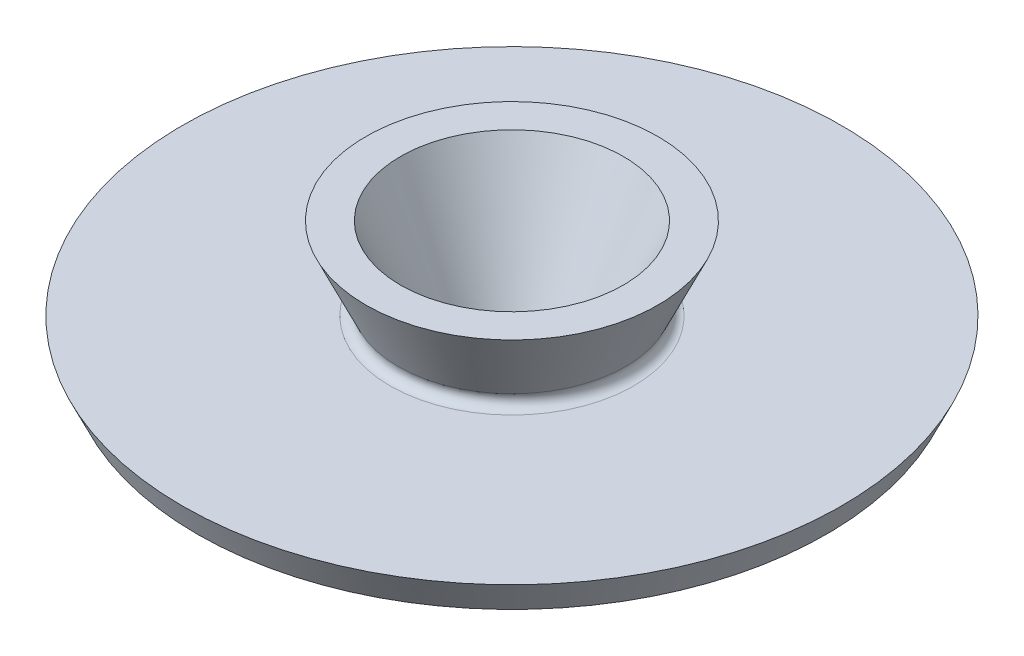
ISO-10303-21;
HEADER;
FILE_DESCRIPTION(('STEP AP214'),'2;1');
FILE_NAME('part.step','',(''),(''),'','','');
FILE_SCHEMA(('AUTOMOTIVE_DESIGN { 1 0 10303 214 1 1 1 1 }'));
ENDSEC;
DATA;
#1=APPLICATION_CONTEXT('core data for automotive mechanical design processes');
#2=APPLICATION_PROTOCOL_DEFINITION('international standard','automotive_design',2000,#1);
#3=PRODUCT_CONTEXT('',#1,'mechanical');
#4=PRODUCT('Part','Part','',(#3));
#5=PRODUCT_RELATED_PRODUCT_CATEGORY('part','',(#4));
#6=PRODUCT_DEFINITION_FORMATION('','',#4);
#7=PRODUCT_DEFINITION_CONTEXT('part definition',#1,'design');
#8=PRODUCT_DEFINITION('design','',#6,#7);
#9=PRODUCT_DEFINITION_SHAPE('','',#8);
#10=(LENGTH_UNIT() NAMED_UNIT(*) SI_UNIT(.MILLI.,.METRE.));
#11=(NAMED_UNIT(*) PLANE_ANGLE_UNIT() SI_UNIT($,.RADIAN.));
#12=(NAMED_UNIT(*) SI_UNIT($,.STERADIAN.) SOLID_ANGLE_UNIT());
#13=UNCERTAINTY_MEASURE_WITH_UNIT(LENGTH_MEASURE(1.E-05),#10,'distance_accuracy_value','');
#14=(GEOMETRIC_REPRESENTATION_CONTEXT(3) GLOBAL_UNCERTAINTY_ASSIGNED_CONTEXT((#13)) GLOBAL_UNIT_ASSIGNED_CONTEXT((#10,
#11,#12)) REPRESENTATION_CONTEXT('',''));
#15=CARTESIAN_POINT('',(0.,0.,0.));
#16=DIRECTION('',(0.,0.,1.));
#17=DIRECTION('',(1.,0.,0.));
#18=AXIS2_PLACEMENT_3D('',#15,#16,#17);
#19=CARTESIAN_POINT('',(-93.6738442409776,4.48939488910319,0.));
#20=DIRECTION('',(0.,1.,0.));
#21=DIRECTION('',(0.,0.,1.));
#22=AXIS2_PLACEMENT_3D('',#19,#20,#21);
#23=PLANE('',#22);
#24=CARTESIAN_POINT('',(0.,4.48939488910319,0.));
#25=DIRECTION('',(0.,1.,0.));
#26=DIRECTION('',(0.,0.,1.));
#27=AXIS2_PLACEMENT_3D('',#24,#25,#26);
#28=CIRCLE('',#27,93.6738442409776);
#29=CARTESIAN_POINT('',(0.,4.48939488910319,93.6738442409776));
#30=VERTEX_POINT('',#29);
#31=EDGE_CURVE('E76',#30,#30,#28,.T.);
#32=ORIENTED_EDGE('',*,*,#31,.T.);
#33=EDGE_LOOP('',(#32));
#34=FACE_BOUND('',#33,.T.);
#35=CARTESIAN_POINT('',(0.,4.48939488910319,0.));
#36=DIRECTION('',(0.,1.,0.));
#37=DIRECTION('',(0.,0.,1.));
#38=AXIS2_PLACEMENT_3D('',#35,#36,#37);
#39=CIRCLE('',#38,34.6027975381496);
#40=CARTESIAN_POINT('',(0.,4.48939488910319,34.6027975381496));
#41=VERTEX_POINT('',#40);
#42=EDGE_CURVE('E10',#41,#41,#39,.T.);
#43=ORIENTED_EDGE('',*,*,#42,.F.);
#44=EDGE_LOOP('',(#43));
#45=FACE_BOUND('',#44,.T.);
#46=ADVANCED_FACE('F37',(#34,#45),#23,.T.);
#47=CARTESIAN_POINT('',(0.,7.02939488910319,0.));
#48=DIRECTION('',(0.,1.,0.));
#49=DIRECTION('',(0.,0.,1.));
#50=AXIS2_PLACEMENT_3D('',#47,#48,#49);
#51=TOROIDAL_SURFACE('',#50,34.6027975381496,2.54);
#52=ORIENTED_EDGE('',*,*,#42,.T.);
#53=EDGE_LOOP('',(#52));
#54=FACE_BOUND('',#53,.T.);
#55=CARTESIAN_POINT('',(0.,8.10284527392458,0.));
#56=DIRECTION('',(0.,1.,0.));
#57=DIRECTION('',(0.,0.,1.));
#58=AXIS2_PLACEMENT_3D('',#55,#56,#57);
#59=CIRCLE('',#58,32.3007757590765);
#60=CARTESIAN_POINT('',(0.,8.10284527392458,32.3007757590765));
#61=VERTEX_POINT('',#60);
#62=EDGE_CURVE('E44',#61,#61,#59,.T.);
#63=ORIENTED_EDGE('',*,*,#62,.F.);
#64=EDGE_LOOP('',(#63));
#65=FACE_BOUND('',#64,.T.);
#66=ADVANCED_FACE('F95',(#54,#65),#51,.F.);
#67=CARTESIAN_POINT('',(0.,27.852774652119,0.));
#68=DIRECTION('',(0.,1.,0.));
#69=DIRECTION('',(0.,0.,1.));
#70=AXIS2_PLACEMENT_3D('',#67,#68,#69);
#71=CONICAL_SURFACE('',#70,41.510319076149,0.436332312998584);
#72=ORIENTED_EDGE('',*,*,#62,.T.);
#73=EDGE_LOOP('',(#72));
#74=FACE_BOUND('',#73,.T.);
#75=CARTESIAN_POINT('',(0.,27.852774652119,0.));
#76=DIRECTION('',(0.,1.,0.));
#77=DIRECTION('',(0.,0.,1.));
#78=AXIS2_PLACEMENT_3D('',#75,#76,#77);
#79=CIRCLE('',#78,41.510319076149);
#80=CARTESIAN_POINT('',(0.,27.852774652119,41.510319076149));
#81=VERTEX_POINT('',#80);
#82=EDGE_CURVE('E49',#81,#81,#79,.T.);
#83=ORIENTED_EDGE('',*,*,#82,.F.);
#84=EDGE_LOOP('',(#83));
#85=FACE_BOUND('',#84,.T.);
#86=ADVANCED_FACE('F99',(#74,#85),#71,.T.);
#87=CARTESIAN_POINT('',(-41.510319076149,27.852774652119,0.));
#88=DIRECTION('',(0.,1.,0.));
#89=DIRECTION('',(0.,0.,1.));
#90=AXIS2_PLACEMENT_3D('',#87,#88,#89);
#91=PLANE('',#90);
#92=ORIENTED_EDGE('',*,*,#82,.T.);
#93=EDGE_LOOP('',(#92));
#94=FACE_BOUND('',#93,.T.);
#95=CARTESIAN_POINT('',(0.,27.852774652119,0.));
#96=DIRECTION('',(0.,1.,0.));
#97=DIRECTION('',(0.,0.,1.));
#98=AXIS2_PLACEMENT_3D('',#95,#96,#97);
#99=CIRCLE('',#98,31.6856489220234);
#100=CARTESIAN_POINT('',(0.,27.852774652119,31.6856489220234));
#101=VERTEX_POINT('',#100);
#102=EDGE_CURVE('E54',#101,#101,#99,.T.);
#103=ORIENTED_EDGE('',*,*,#102,.F.);
#104=EDGE_LOOP('',(#103));
#105=FACE_BOUND('',#104,.T.);
#106=ADVANCED_FACE('F103',(#94,#105),#91,.T.);
#107=CARTESIAN_POINT('',(0.,-10.247225347881,0.));
#108=DIRECTION('',(0.,1.,0.));
#109=DIRECTION('',(0.,0.,1.));
#110=AXIS2_PLACEMENT_3D('',#107,#108,#109);
#111=CONICAL_SURFACE('',#110,13.9193271463179,0.436332312998584);
#112=ORIENTED_EDGE('',*,*,#102,.T.);
#113=EDGE_LOOP('',(#112));
#114=FACE_BOUND('',#113,.T.);
#115=CARTESIAN_POINT('',(0.,-10.247225347881,0.));
#116=DIRECTION('',(0.,1.,0.));
#117=DIRECTION('',(0.,0.,1.));
#118=AXIS2_PLACEMENT_3D('',#115,#116,#117);
#119=CIRCLE('',#118,13.9193271463179);
#120=CARTESIAN_POINT('',(0.,-10.247225347881,13.9193271463179));
#121=VERTEX_POINT('',#120);
#122=EDGE_CURVE('E60',#121,#121,#119,.T.);
#123=ORIENTED_EDGE('',*,*,#122,.F.);
#124=EDGE_LOOP('',(#123));
#125=FACE_BOUND('',#124,.T.);
#126=ADVANCED_FACE('F109',(#114,#125),#111,.F.);
#127=CARTESIAN_POINT('',(-17.828614800201,-10.247225347881,0.));
#128=DIRECTION('',(0.,-1.,0.));
#129=DIRECTION('',(0.,0.,-1.));
#130=AXIS2_PLACEMENT_3D('',#127,#128,#129);
#131=PLANE('',#130);
#132=ORIENTED_EDGE('',*,*,#122,.T.);
#133=EDGE_LOOP('',(#132));
#134=FACE_BOUND('',#133,.T.);
#135=CARTESIAN_POINT('',(0.,-10.247225347881,0.));
#136=DIRECTION('',(0.,1.,0.));
#137=DIRECTION('',(0.,0.,1.));
#138=AXIS2_PLACEMENT_3D('',#135,#136,#137);
#139=CIRCLE('',#138,17.828614800201);
#140=CARTESIAN_POINT('',(0.,-10.247225347881,17.828614800201));
#141=VERTEX_POINT('',#140);
#142=EDGE_CURVE('E64',#141,#141,#139,.T.);
#143=ORIENTED_EDGE('',*,*,#142,.F.);
#144=EDGE_LOOP('',(#143));
#145=FACE_BOUND('',#144,.T.);
#146=ADVANCED_FACE('F113',(#134,#145),#131,.T.);
#147=CARTESIAN_POINT('',(0.,-4.57517016471538,0.));
#148=DIRECTION('',(0.,1.,0.));
#149=DIRECTION('',(0.,0.,1.));
#150=AXIS2_PLACEMENT_3D('',#147,#148,#149);
#151=CONICAL_SURFACE('',#150,20.4735375695889,0.436332312998584);
#152=ORIENTED_EDGE('',*,*,#142,.T.);
#153=EDGE_LOOP('',(#152));
#154=FACE_BOUND('',#153,.T.);
#155=CARTESIAN_POINT('',(0.,-4.57517016471538,0.));
#156=DIRECTION('',(0.,1.,0.));
#157=DIRECTION('',(0.,0.,1.));
#158=AXIS2_PLACEMENT_3D('',#155,#156,#157);
#159=CIRCLE('',#158,20.4735375695889);
#160=CARTESIAN_POINT('',(0.,-4.57517016471538,20.4735375695889));
#161=VERTEX_POINT('',#160);
#162=EDGE_CURVE('E68',#161,#161,#159,.T.);
#163=ORIENTED_EDGE('',*,*,#162,.F.);
#164=EDGE_LOOP('',(#163));
#165=FACE_BOUND('',#164,.T.);
#166=ADVANCED_FACE('F91',(#154,#165),#151,.T.);
#167=CARTESIAN_POINT('',(-89.4469681385378,-4.57517016471538,0.));
#168=DIRECTION('',(0.,-1.,0.));
#169=DIRECTION('',(0.,0.,-1.));
#170=AXIS2_PLACEMENT_3D('',#167,#168,#169);
#171=PLANE('',#170);
#172=ORIENTED_EDGE('',*,*,#162,.T.);
#173=EDGE_LOOP('',(#172));
#174=FACE_BOUND('',#173,.T.);
#175=CARTESIAN_POINT('',(0.,-4.57517016471538,0.));
#176=DIRECTION('',(0.,1.,0.));
#177=DIRECTION('',(0.,0.,1.));
#178=AXIS2_PLACEMENT_3D('',#175,#176,#177);
#179=CIRCLE('',#178,89.4469681385378);
#180=CARTESIAN_POINT('',(0.,-4.57517016471538,89.4469681385378));
#181=VERTEX_POINT('',#180);
#182=EDGE_CURVE('E72',#181,#181,#179,.T.);
#183=ORIENTED_EDGE('',*,*,#182,.F.);
#184=EDGE_LOOP('',(#183));
#185=FACE_BOUND('',#184,.T.);
#186=ADVANCED_FACE('F85',(#174,#185),#171,.T.);
#187=CARTESIAN_POINT('',(0.,4.48939488910319,0.));
#188=DIRECTION('',(0.,1.,0.));
#189=DIRECTION('',(0.,0.,1.));
#190=AXIS2_PLACEMENT_3D('',#187,#188,#189);
#191=CONICAL_SURFACE('',#190,93.6738442409776,0.436332312998583);
#192=ORIENTED_EDGE('',*,*,#182,.T.);
#193=EDGE_LOOP('',(#192));
#194=FACE_BOUND('',#193,.T.);
#195=ORIENTED_EDGE('',*,*,#31,.F.);
#196=EDGE_LOOP('',(#195));
#197=FACE_BOUND('',#196,.T.);
#198=ADVANCED_FACE('F83',(#194,#197),#191,.T.);
#199=CLOSED_SHELL('',(#46,#66,#86,#106,#126,#146,#166,#186,#198));
#200=MANIFOLD_SOLID_BREP('B2',#199);
#201=ADVANCED_BREP_SHAPE_REPRESENTATION('',(#18,#200),#14);
#202=SHAPE_DEFINITION_REPRESENTATION(#9,#201);
ENDSEC;
END-ISO-10303-21;
